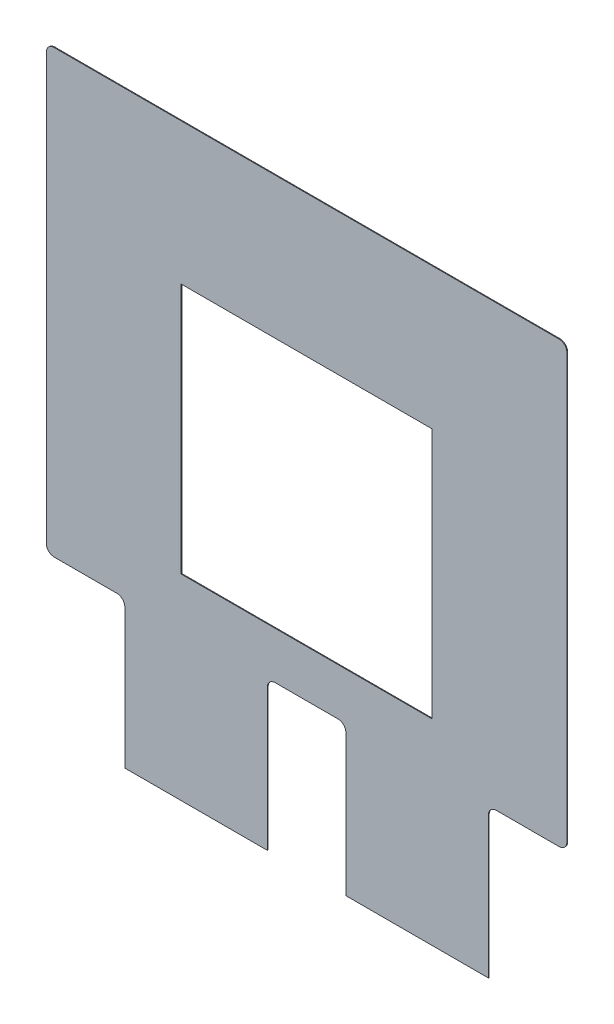
ISO-10303-21;
HEADER;
FILE_DESCRIPTION(('STEP AP214'),'2;1');
FILE_NAME('part.step','',(''),(''),'','','');
FILE_SCHEMA(('AUTOMOTIVE_DESIGN { 1 0 10303 214 1 1 1 1 }'));
ENDSEC;
DATA;
#1=APPLICATION_CONTEXT('core data for automotive mechanical design processes');
#2=APPLICATION_PROTOCOL_DEFINITION('international standard','automotive_design',2000,#1);
#3=PRODUCT_CONTEXT('',#1,'mechanical');
#4=PRODUCT('Part','Part','',(#3));
#5=PRODUCT_RELATED_PRODUCT_CATEGORY('part','',(#4));
#6=PRODUCT_DEFINITION_FORMATION('','',#4);
#7=PRODUCT_DEFINITION_CONTEXT('part definition',#1,'design');
#8=PRODUCT_DEFINITION('design','',#6,#7);
#9=PRODUCT_DEFINITION_SHAPE('','',#8);
#10=(LENGTH_UNIT() NAMED_UNIT(*) SI_UNIT(.MILLI.,.METRE.));
#11=(NAMED_UNIT(*) PLANE_ANGLE_UNIT() SI_UNIT($,.RADIAN.));
#12=(NAMED_UNIT(*) SI_UNIT($,.STERADIAN.) SOLID_ANGLE_UNIT());
#13=UNCERTAINTY_MEASURE_WITH_UNIT(LENGTH_MEASURE(1.E-05),#10,'distance_accuracy_value','');
#14=(GEOMETRIC_REPRESENTATION_CONTEXT(3) GLOBAL_UNCERTAINTY_ASSIGNED_CONTEXT((#13)) GLOBAL_UNIT_ASSIGNED_CONTEXT((#10,
#11,#12)) REPRESENTATION_CONTEXT('',''));
#15=CARTESIAN_POINT('',(0.,0.,0.));
#16=DIRECTION('',(0.,0.,1.));
#17=DIRECTION('',(1.,0.,0.));
#18=AXIS2_PLACEMENT_3D('',#15,#16,#17);
#19=CARTESIAN_POINT('',(47.7124343833155,28.0822771712,0.1));
#20=DIRECTION('',(0.,0.,1.));
#21=DIRECTION('',(1.,0.,0.));
#22=AXIS2_PLACEMENT_3D('',#19,#20,#21);
#23=PLANE('',#22);
#24=CARTESIAN_POINT('',(47.7124343833155,28.0822771712,0.1));
#25=DIRECTION('',(0.,0.,1.));
#26=DIRECTION('',(1.,0.,0.));
#27=AXIS2_PLACEMENT_3D('',#24,#25,#26);
#28=CIRCLE('',#27,1.);
#29=CARTESIAN_POINT('',(48.7124343833155,28.0822771712,0.1));
#30=VERTEX_POINT('',#29);
#31=CARTESIAN_POINT('',(47.7124343833155,29.0822771712,0.1));
#32=VERTEX_POINT('',#31);
#33=EDGE_CURVE('E230',#30,#32,#28,.T.);
#34=ORIENTED_EDGE('',*,*,#33,.T.);
#35=DIRECTION('',(-1.,0.,0.));
#36=VECTOR('',#35,1.);
#37=CARTESIAN_POINT('',(34.7124343833154,29.0822771712,0.1));
#38=LINE('',#37,#36);
#39=CARTESIAN_POINT('',(-16.614788352,29.0822771712,0.1));
#40=VERTEX_POINT('',#39);
#41=EDGE_CURVE('E233',#32,#40,#38,.T.);
#42=ORIENTED_EDGE('',*,*,#41,.T.);
#43=CARTESIAN_POINT('',(-16.614788352,28.0822771712,0.1));
#44=DIRECTION('',(0.,0.,1.));
#45=DIRECTION('',(1.,0.,0.));
#46=AXIS2_PLACEMENT_3D('',#43,#44,#45);
#47=CIRCLE('',#46,1.);
#48=CARTESIAN_POINT('',(-17.614788352,28.0822771712,0.1));
#49=VERTEX_POINT('',#48);
#50=EDGE_CURVE('E236',#40,#49,#47,.T.);
#51=ORIENTED_EDGE('',*,*,#50,.T.);
#52=DIRECTION('',(0.,-1.,0.));
#53=VECTOR('',#52,1.);
#54=CARTESIAN_POINT('',(-17.614788352,28.0822771712,0.1));
#55=LINE('',#54,#53);
#56=CARTESIAN_POINT('',(-17.614788352,-26.1394487439421,0.1));
#57=VERTEX_POINT('',#56);
#58=EDGE_CURVE('E238',#49,#57,#55,.T.);
#59=ORIENTED_EDGE('',*,*,#58,.T.);
#60=CARTESIAN_POINT('',(-16.614788352,-26.1394487439421,0.1));
#61=DIRECTION('',(0.,0.,1.));
#62=DIRECTION('',(1.,0.,0.));
#63=AXIS2_PLACEMENT_3D('',#60,#61,#62);
#64=CIRCLE('',#63,1.);
#65=CARTESIAN_POINT('',(-16.614788352,-27.1394487439421,0.1));
#66=VERTEX_POINT('',#65);
#67=EDGE_CURVE('E240',#57,#66,#64,.T.);
#68=ORIENTED_EDGE('',*,*,#67,.T.);
#69=DIRECTION('',(1.,0.,0.));
#70=VECTOR('',#69,1.);
#71=CARTESIAN_POINT('',(-16.614788352,-27.1394487439421,0.1));
#72=LINE('',#71,#70);
#73=CARTESIAN_POINT('',(-8.61478835200001,-27.1394487439421,0.1));
#74=VERTEX_POINT('',#73);
#75=EDGE_CURVE('E242',#66,#74,#72,.T.);
#76=ORIENTED_EDGE('',*,*,#75,.T.);
#77=CARTESIAN_POINT('',(-8.61478835200001,-28.1394487439421,0.1));
#78=DIRECTION('',(0.,0.,-1.));
#79=DIRECTION('',(1.,0.,0.));
#80=AXIS2_PLACEMENT_3D('',#77,#78,#79);
#81=CIRCLE('',#80,0.999999999999999);
#82=CARTESIAN_POINT('',(-7.61478835200001,-28.1394487439421,0.1));
#83=VERTEX_POINT('',#82);
#84=EDGE_CURVE('E244',#74,#83,#81,.T.);
#85=ORIENTED_EDGE('',*,*,#84,.T.);
#86=DIRECTION('',(0.,-1.,0.));
#87=VECTOR('',#86,1.);
#88=CARTESIAN_POINT('',(-7.61478835200001,-28.1394487439421,0.1));
#89=LINE('',#88,#87);
#90=CARTESIAN_POINT('',(-7.61478835200001,-45.9177228288,0.1));
#91=VERTEX_POINT('',#90);
#92=EDGE_CURVE('E246',#83,#91,#89,.T.);
#93=ORIENTED_EDGE('',*,*,#92,.T.);
#94=DIRECTION('',(1.,0.,0.));
#95=VECTOR('',#94,1.);
#96=CARTESIAN_POINT('',(-7.61478835200001,-45.9177228288,0.1));
#97=LINE('',#96,#95);
#98=CARTESIAN_POINT('',(10.5488230156577,-45.9177228288,0.1));
#99=VERTEX_POINT('',#98);
#100=EDGE_CURVE('E248',#91,#99,#97,.T.);
#101=ORIENTED_EDGE('',*,*,#100,.T.);
#102=DIRECTION('',(0.,1.,0.));
#103=VECTOR('',#102,1.);
#104=CARTESIAN_POINT('',(10.5488230156577,-45.9177228288,0.1));
#105=LINE('',#104,#103);
#106=CARTESIAN_POINT('',(10.5488230156577,-27.9177228288,0.1));
#107=VERTEX_POINT('',#106);
#108=EDGE_CURVE('E250',#99,#107,#105,.T.);
#109=ORIENTED_EDGE('',*,*,#108,.T.);
#110=CARTESIAN_POINT('',(11.5488230156577,-27.9177228288,0.1));
#111=DIRECTION('',(0.,0.,-1.));
#112=DIRECTION('',(1.,0.,0.));
#113=AXIS2_PLACEMENT_3D('',#110,#111,#112);
#114=CIRCLE('',#113,0.999999999999994);
#115=CARTESIAN_POINT('',(11.5488230156577,-26.9177228288,0.1));
#116=VERTEX_POINT('',#115);
#117=EDGE_CURVE('E252',#107,#116,#114,.T.);
#118=ORIENTED_EDGE('',*,*,#117,.T.);
#119=DIRECTION('',(1.,0.,0.));
#120=VECTOR('',#119,1.);
#121=CARTESIAN_POINT('',(11.5488230156577,-26.9177228288,0.1));
#122=LINE('',#121,#120);
#123=CARTESIAN_POINT('',(19.5488230156577,-26.9177228288,0.1));
#124=VERTEX_POINT('',#123);
#125=EDGE_CURVE('E254',#116,#124,#122,.T.);
#126=ORIENTED_EDGE('',*,*,#125,.T.);
#127=CARTESIAN_POINT('',(19.5488230156577,-27.9177228288,0.1));
#128=DIRECTION('',(0.,0.,-1.));
#129=DIRECTION('',(1.,0.,0.));
#130=AXIS2_PLACEMENT_3D('',#127,#128,#129);
#131=CIRCLE('',#130,0.999999999999994);
#132=CARTESIAN_POINT('',(20.5488230156577,-27.9177228288,0.1));
#133=VERTEX_POINT('',#132);
#134=EDGE_CURVE('E256',#124,#133,#131,.T.);
#135=ORIENTED_EDGE('',*,*,#134,.T.);
#136=DIRECTION('',(0.,-1.,0.));
#137=VECTOR('',#136,1.);
#138=CARTESIAN_POINT('',(20.5488230156577,-27.9177228288,0.1));
#139=LINE('',#138,#137);
#140=CARTESIAN_POINT('',(20.5488230156577,-45.9177228288,0.1));
#141=VERTEX_POINT('',#140);
#142=EDGE_CURVE('E258',#133,#141,#139,.T.);
#143=ORIENTED_EDGE('',*,*,#142,.T.);
#144=DIRECTION('',(1.,0.,0.));
#145=VECTOR('',#144,1.);
#146=CARTESIAN_POINT('',(20.5488230156577,-45.9177228288,0.1));
#147=LINE('',#146,#145);
#148=CARTESIAN_POINT('',(38.7124343833155,-45.9177228288,0.1));
#149=VERTEX_POINT('',#148);
#150=EDGE_CURVE('E260',#141,#149,#147,.T.);
#151=ORIENTED_EDGE('',*,*,#150,.T.);
#152=DIRECTION('',(0.,1.,0.));
#153=VECTOR('',#152,1.);
#154=CARTESIAN_POINT('',(38.7124343833155,-45.9177228288,0.1));
#155=LINE('',#154,#153);
#156=CARTESIAN_POINT('',(38.7124343833155,-27.9177228288,0.1));
#157=VERTEX_POINT('',#156);
#158=EDGE_CURVE('E262',#149,#157,#155,.T.);
#159=ORIENTED_EDGE('',*,*,#158,.T.);
#160=CARTESIAN_POINT('',(39.7124343833154,-27.9177228288,0.1));
#161=DIRECTION('',(0.,0.,-1.));
#162=DIRECTION('',(1.,0.,0.));
#163=AXIS2_PLACEMENT_3D('',#160,#161,#162);
#164=CIRCLE('',#163,0.999999999999987);
#165=CARTESIAN_POINT('',(39.7124343833154,-26.9177228288,0.1));
#166=VERTEX_POINT('',#165);
#167=EDGE_CURVE('E264',#157,#166,#164,.T.);
#168=ORIENTED_EDGE('',*,*,#167,.T.);
#169=DIRECTION('',(1.,0.,0.));
#170=VECTOR('',#169,1.);
#171=CARTESIAN_POINT('',(39.7124343833154,-26.9177228288,0.1));
#172=LINE('',#171,#170);
#173=CARTESIAN_POINT('',(47.7124343833155,-26.9177228288,0.1));
#174=VERTEX_POINT('',#173);
#175=EDGE_CURVE('E266',#166,#174,#172,.T.);
#176=ORIENTED_EDGE('',*,*,#175,.T.);
#177=CARTESIAN_POINT('',(47.7124343833155,-25.9177228288,0.1));
#178=DIRECTION('',(0.,0.,1.));
#179=DIRECTION('',(1.,0.,0.));
#180=AXIS2_PLACEMENT_3D('',#177,#178,#179);
#181=CIRCLE('',#180,1.);
#182=CARTESIAN_POINT('',(48.7124343833155,-25.9177228288,0.1));
#183=VERTEX_POINT('',#182);
#184=EDGE_CURVE('E268',#174,#183,#181,.T.);
#185=ORIENTED_EDGE('',*,*,#184,.T.);
#186=DIRECTION('',(0.,1.,0.));
#187=VECTOR('',#186,1.);
#188=CARTESIAN_POINT('',(48.7124343833155,-25.9177228288,0.1));
#189=LINE('',#188,#187);
#190=EDGE_CURVE('E270',#183,#30,#189,.T.);
#191=ORIENTED_EDGE('',*,*,#190,.T.);
#192=EDGE_LOOP('',(#34,#42,#51,#59,#68,#76,#85,#93,#101,#109,#118,#126,#135,#143,#151,#159,#168,
#176,#185,#191));
#193=FACE_BOUND('',#192,.T.);
#194=DIRECTION('',(0.,-1.,0.));
#195=VECTOR('',#194,1.);
#196=CARTESIAN_POINT('',(-0.451176984342311,-20.9177228288,0.1));
#197=LINE('',#196,#195);
#198=CARTESIAN_POINT('',(-0.451176984342297,11.0822771712,0.1));
#199=VERTEX_POINT('',#198);
#200=CARTESIAN_POINT('',(-0.451176984342311,-20.9177228288,0.1));
#201=VERTEX_POINT('',#200);
#202=EDGE_CURVE('E200',#199,#201,#197,.T.);
#203=ORIENTED_EDGE('',*,*,#202,.F.);
#204=DIRECTION('',(-1.,0.,0.));
#205=VECTOR('',#204,1.);
#206=CARTESIAN_POINT('',(16.0488230156577,11.0822771712,0.1));
#207=LINE('',#206,#205);
#208=CARTESIAN_POINT('',(31.5488230156577,11.0822771712,0.1));
#209=VERTEX_POINT('',#208);
#210=EDGE_CURVE('E192',#209,#199,#207,.T.);
#211=ORIENTED_EDGE('',*,*,#210,.F.);
#212=DIRECTION('',(0.,1.,0.));
#213=VECTOR('',#212,1.);
#214=CARTESIAN_POINT('',(31.5488230156577,11.0822771712,0.1));
#215=LINE('',#214,#213);
#216=CARTESIAN_POINT('',(31.5488230156577,-20.9177228288,0.1));
#217=VERTEX_POINT('',#216);
#218=EDGE_CURVE('E215',#217,#209,#215,.T.);
#219=ORIENTED_EDGE('',*,*,#218,.F.);
#220=DIRECTION('',(1.,0.,0.));
#221=VECTOR('',#220,1.);
#222=CARTESIAN_POINT('',(31.5488230156577,-20.9177228288,0.1));
#223=LINE('',#222,#221);
#224=EDGE_CURVE('E213',#201,#217,#223,.T.);
#225=ORIENTED_EDGE('',*,*,#224,.F.);
#226=EDGE_LOOP('',(#203,#211,#219,#225));
#227=FACE_BOUND('',#226,.T.);
#228=ADVANCED_FACE('F33',(#193,#227),#23,.T.);
#229=CARTESIAN_POINT('',(47.7124343833155,28.0822771712,0.));
#230=DIRECTION('',(0.,0.,1.));
#231=DIRECTION('',(1.,0.,0.));
#232=AXIS2_PLACEMENT_3D('',#229,#230,#231);
#233=PLANE('',#232);
#234=CARTESIAN_POINT('',(47.7124343833155,28.0822771712,0.));
#235=DIRECTION('',(0.,0.,1.));
#236=DIRECTION('',(1.,0.,0.));
#237=AXIS2_PLACEMENT_3D('',#234,#235,#236);
#238=CIRCLE('',#237,1.);
#239=CARTESIAN_POINT('',(48.7124343833155,28.0822771712,0.));
#240=VERTEX_POINT('',#239);
#241=CARTESIAN_POINT('',(47.7124343833155,29.0822771712,0.));
#242=VERTEX_POINT('',#241);
#243=EDGE_CURVE('E209',#240,#242,#238,.T.);
#244=ORIENTED_EDGE('',*,*,#243,.F.);
#245=DIRECTION('',(0.,1.,0.));
#246=VECTOR('',#245,1.);
#247=CARTESIAN_POINT('',(48.7124343833155,-25.9177228288,0.));
#248=LINE('',#247,#246);
#249=CARTESIAN_POINT('',(48.7124343833155,-25.9177228288,0.));
#250=VERTEX_POINT('',#249);
#251=EDGE_CURVE('E234',#250,#240,#248,.T.);
#252=ORIENTED_EDGE('',*,*,#251,.F.);
#253=CARTESIAN_POINT('',(47.7124343833155,-25.9177228288,0.));
#254=DIRECTION('',(0.,0.,1.));
#255=DIRECTION('',(1.,0.,0.));
#256=AXIS2_PLACEMENT_3D('',#253,#254,#255);
#257=CIRCLE('',#256,1.);
#258=CARTESIAN_POINT('',(47.7124343833155,-26.9177228288,0.));
#259=VERTEX_POINT('',#258);
#260=EDGE_CURVE('E309',#259,#250,#257,.T.);
#261=ORIENTED_EDGE('',*,*,#260,.F.);
#262=DIRECTION('',(1.,0.,0.));
#263=VECTOR('',#262,1.);
#264=CARTESIAN_POINT('',(39.7124343833154,-26.9177228288,0.));
#265=LINE('',#264,#263);
#266=CARTESIAN_POINT('',(39.7124343833154,-26.9177228288,0.));
#267=VERTEX_POINT('',#266);
#268=EDGE_CURVE('E307',#267,#259,#265,.T.);
#269=ORIENTED_EDGE('',*,*,#268,.F.);
#270=CARTESIAN_POINT('',(39.7124343833154,-27.9177228288,0.));
#271=DIRECTION('',(0.,0.,-1.));
#272=DIRECTION('',(1.,0.,0.));
#273=AXIS2_PLACEMENT_3D('',#270,#271,#272);
#274=CIRCLE('',#273,0.999999999999987);
#275=CARTESIAN_POINT('',(38.7124343833155,-27.9177228288,0.));
#276=VERTEX_POINT('',#275);
#277=EDGE_CURVE('E305',#276,#267,#274,.T.);
#278=ORIENTED_EDGE('',*,*,#277,.F.);
#279=DIRECTION('',(0.,1.,0.));
#280=VECTOR('',#279,1.);
#281=CARTESIAN_POINT('',(38.7124343833155,-45.9177228288,0.));
#282=LINE('',#281,#280);
#283=CARTESIAN_POINT('',(38.7124343833155,-45.9177228288,0.));
#284=VERTEX_POINT('',#283);
#285=EDGE_CURVE('E303',#284,#276,#282,.T.);
#286=ORIENTED_EDGE('',*,*,#285,.F.);
#287=DIRECTION('',(1.,0.,0.));
#288=VECTOR('',#287,1.);
#289=CARTESIAN_POINT('',(20.5488230156577,-45.9177228288,0.));
#290=LINE('',#289,#288);
#291=CARTESIAN_POINT('',(20.5488230156577,-45.9177228288,0.));
#292=VERTEX_POINT('',#291);
#293=EDGE_CURVE('E301',#292,#284,#290,.T.);
#294=ORIENTED_EDGE('',*,*,#293,.F.);
#295=DIRECTION('',(0.,-1.,0.));
#296=VECTOR('',#295,1.);
#297=CARTESIAN_POINT('',(20.5488230156577,-27.9177228288,0.));
#298=LINE('',#297,#296);
#299=CARTESIAN_POINT('',(20.5488230156577,-27.9177228288,0.));
#300=VERTEX_POINT('',#299);
#301=EDGE_CURVE('E299',#300,#292,#298,.T.);
#302=ORIENTED_EDGE('',*,*,#301,.F.);
#303=CARTESIAN_POINT('',(19.5488230156577,-27.9177228288,0.));
#304=DIRECTION('',(0.,0.,-1.));
#305=DIRECTION('',(1.,0.,0.));
#306=AXIS2_PLACEMENT_3D('',#303,#304,#305);
#307=CIRCLE('',#306,0.999999999999994);
#308=CARTESIAN_POINT('',(19.5488230156577,-26.9177228288,0.));
#309=VERTEX_POINT('',#308);
#310=EDGE_CURVE('E297',#309,#300,#307,.T.);
#311=ORIENTED_EDGE('',*,*,#310,.F.);
#312=DIRECTION('',(1.,0.,0.));
#313=VECTOR('',#312,1.);
#314=CARTESIAN_POINT('',(11.5488230156577,-26.9177228288,0.));
#315=LINE('',#314,#313);
#316=CARTESIAN_POINT('',(11.5488230156577,-26.9177228288,0.));
#317=VERTEX_POINT('',#316);
#318=EDGE_CURVE('E295',#317,#309,#315,.T.);
#319=ORIENTED_EDGE('',*,*,#318,.F.);
#320=CARTESIAN_POINT('',(11.5488230156577,-27.9177228288,0.));
#321=DIRECTION('',(0.,0.,-1.));
#322=DIRECTION('',(1.,0.,0.));
#323=AXIS2_PLACEMENT_3D('',#320,#321,#322);
#324=CIRCLE('',#323,0.999999999999994);
#325=CARTESIAN_POINT('',(10.5488230156577,-27.9177228288,0.));
#326=VERTEX_POINT('',#325);
#327=EDGE_CURVE('E293',#326,#317,#324,.T.);
#328=ORIENTED_EDGE('',*,*,#327,.F.);
#329=DIRECTION('',(0.,1.,0.));
#330=VECTOR('',#329,1.);
#331=CARTESIAN_POINT('',(10.5488230156577,-45.9177228288,0.));
#332=LINE('',#331,#330);
#333=CARTESIAN_POINT('',(10.5488230156577,-45.9177228288,0.));
#334=VERTEX_POINT('',#333);
#335=EDGE_CURVE('E291',#334,#326,#332,.T.);
#336=ORIENTED_EDGE('',*,*,#335,.F.);
#337=DIRECTION('',(1.,0.,0.));
#338=VECTOR('',#337,1.);
#339=CARTESIAN_POINT('',(-7.61478835200001,-45.9177228288,0.));
#340=LINE('',#339,#338);
#341=CARTESIAN_POINT('',(-7.61478835200001,-45.9177228288,0.));
#342=VERTEX_POINT('',#341);
#343=EDGE_CURVE('E289',#342,#334,#340,.T.);
#344=ORIENTED_EDGE('',*,*,#343,.F.);
#345=DIRECTION('',(0.,-1.,0.));
#346=VECTOR('',#345,1.);
#347=CARTESIAN_POINT('',(-7.61478835200001,-28.1394487439421,0.));
#348=LINE('',#347,#346);
#349=CARTESIAN_POINT('',(-7.61478835200001,-28.1394487439421,0.));
#350=VERTEX_POINT('',#349);
#351=EDGE_CURVE('E287',#350,#342,#348,.T.);
#352=ORIENTED_EDGE('',*,*,#351,.F.);
#353=CARTESIAN_POINT('',(-8.61478835200001,-28.1394487439421,0.));
#354=DIRECTION('',(0.,0.,-1.));
#355=DIRECTION('',(1.,0.,0.));
#356=AXIS2_PLACEMENT_3D('',#353,#354,#355);
#357=CIRCLE('',#356,0.999999999999999);
#358=CARTESIAN_POINT('',(-8.61478835200001,-27.1394487439421,0.));
#359=VERTEX_POINT('',#358);
#360=EDGE_CURVE('E285',#359,#350,#357,.T.);
#361=ORIENTED_EDGE('',*,*,#360,.F.);
#362=DIRECTION('',(1.,0.,0.));
#363=VECTOR('',#362,1.);
#364=CARTESIAN_POINT('',(-16.614788352,-27.1394487439421,0.));
#365=LINE('',#364,#363);
#366=CARTESIAN_POINT('',(-16.614788352,-27.1394487439421,0.));
#367=VERTEX_POINT('',#366);
#368=EDGE_CURVE('E283',#367,#359,#365,.T.);
#369=ORIENTED_EDGE('',*,*,#368,.F.);
#370=CARTESIAN_POINT('',(-16.614788352,-26.1394487439421,0.));
#371=DIRECTION('',(0.,0.,1.));
#372=DIRECTION('',(1.,0.,0.));
#373=AXIS2_PLACEMENT_3D('',#370,#371,#372);
#374=CIRCLE('',#373,1.);
#375=CARTESIAN_POINT('',(-17.614788352,-26.1394487439421,0.));
#376=VERTEX_POINT('',#375);
#377=EDGE_CURVE('E281',#376,#367,#374,.T.);
#378=ORIENTED_EDGE('',*,*,#377,.F.);
#379=DIRECTION('',(0.,-1.,0.));
#380=VECTOR('',#379,1.);
#381=CARTESIAN_POINT('',(-17.614788352,28.0822771712,0.));
#382=LINE('',#381,#380);
#383=CARTESIAN_POINT('',(-17.614788352,28.0822771712,0.));
#384=VERTEX_POINT('',#383);
#385=EDGE_CURVE('E279',#384,#376,#382,.T.);
#386=ORIENTED_EDGE('',*,*,#385,.F.);
#387=CARTESIAN_POINT('',(-16.614788352,28.0822771712,0.));
#388=DIRECTION('',(0.,0.,1.));
#389=DIRECTION('',(1.,0.,0.));
#390=AXIS2_PLACEMENT_3D('',#387,#388,#389);
#391=CIRCLE('',#390,1.);
#392=CARTESIAN_POINT('',(-16.614788352,29.0822771712,0.));
#393=VERTEX_POINT('',#392);
#394=EDGE_CURVE('E277',#393,#384,#391,.T.);
#395=ORIENTED_EDGE('',*,*,#394,.F.);
#396=DIRECTION('',(-1.,0.,0.));
#397=VECTOR('',#396,1.);
#398=CARTESIAN_POINT('',(-3.61478835200001,29.0822771712,0.));
#399=LINE('',#398,#397);
#400=EDGE_CURVE('E275',#242,#393,#399,.T.);
#401=ORIENTED_EDGE('',*,*,#400,.F.);
#402=EDGE_LOOP('',(#244,#252,#261,#269,#278,#286,#294,#302,#311,#319,#328,#336,#344,#352,#361,
#369,#378,#386,#395,#401));
#403=FACE_BOUND('',#402,.T.);
#404=DIRECTION('',(-1.,0.,0.));
#405=VECTOR('',#404,1.);
#406=CARTESIAN_POINT('',(-0.451176984342297,11.0822771712,0.));
#407=LINE('',#406,#405);
#408=CARTESIAN_POINT('',(31.5488230156577,11.0822771712,0.));
#409=VERTEX_POINT('',#408);
#410=CARTESIAN_POINT('',(-0.451176984342297,11.0822771712,0.));
#411=VERTEX_POINT('',#410);
#412=EDGE_CURVE('E219',#409,#411,#407,.T.);
#413=ORIENTED_EDGE('',*,*,#412,.T.);
#414=DIRECTION('',(0.,-1.,0.));
#415=VECTOR('',#414,1.);
#416=CARTESIAN_POINT('',(-0.451176984342311,-20.9177228288,0.));
#417=LINE('',#416,#415);
#418=CARTESIAN_POINT('',(-0.451176984342311,-20.9177228288,0.));
#419=VERTEX_POINT('',#418);
#420=EDGE_CURVE('E207',#411,#419,#417,.T.);
#421=ORIENTED_EDGE('',*,*,#420,.T.);
#422=DIRECTION('',(1.,0.,0.));
#423=VECTOR('',#422,1.);
#424=CARTESIAN_POINT('',(31.5488230156577,-20.9177228288,0.));
#425=LINE('',#424,#423);
#426=CARTESIAN_POINT('',(31.5488230156577,-20.9177228288,0.));
#427=VERTEX_POINT('',#426);
#428=EDGE_CURVE('E222',#419,#427,#425,.T.);
#429=ORIENTED_EDGE('',*,*,#428,.T.);
#430=DIRECTION('',(0.,1.,0.));
#431=VECTOR('',#430,1.);
#432=CARTESIAN_POINT('',(31.5488230156577,11.0822771712,0.));
#433=LINE('',#432,#431);
#434=EDGE_CURVE('E201',#427,#409,#433,.T.);
#435=ORIENTED_EDGE('',*,*,#434,.T.);
#436=EDGE_LOOP('',(#413,#421,#429,#435));
#437=FACE_BOUND('',#436,.T.);
#438=ADVANCED_FACE('F375',(#403,#437),#233,.F.);
#439=CARTESIAN_POINT('',(47.7124343833155,28.0822771712,0.1));
#440=DIRECTION('',(0.,0.,-1.));
#441=DIRECTION('',(-1.,0.,0.));
#442=AXIS2_PLACEMENT_3D('',#439,#440,#441);
#443=CYLINDRICAL_SURFACE('',#442,1.);
#444=ORIENTED_EDGE('',*,*,#243,.T.);
#445=DIRECTION('',(0.,0.,-1.));
#446=VECTOR('',#445,1.);
#447=CARTESIAN_POINT('',(47.7124343833155,29.0822771712,0.1));
#448=LINE('',#447,#446);
#449=EDGE_CURVE('E11',#32,#242,#448,.T.);
#450=ORIENTED_EDGE('',*,*,#449,.F.);
#451=ORIENTED_EDGE('',*,*,#33,.F.);
#452=DIRECTION('',(0.,0.,-1.));
#453=VECTOR('',#452,1.);
#454=CARTESIAN_POINT('',(48.7124343833155,28.0822771712,0.1));
#455=LINE('',#454,#453);
#456=EDGE_CURVE('E272',#30,#240,#455,.T.);
#457=ORIENTED_EDGE('',*,*,#456,.T.);
#458=EDGE_LOOP('',(#444,#450,#451,#457));
#459=FACE_BOUND('',#458,.T.);
#460=ADVANCED_FACE('F35',(#459),#443,.T.);
#461=CARTESIAN_POINT('',(-3.61478835200001,29.0822771712,0.1));
#462=DIRECTION('',(0.,-1.,0.));
#463=DIRECTION('',(1.,0.,0.));
#464=AXIS2_PLACEMENT_3D('',#461,#462,#463);
#465=PLANE('',#464);
#466=ORIENTED_EDGE('',*,*,#400,.T.);
#467=DIRECTION('',(0.,0.,-1.));
#468=VECTOR('',#467,1.);
#469=CARTESIAN_POINT('',(-16.614788352,29.0822771712,0.1));
#470=LINE('',#469,#468);
#471=EDGE_CURVE('E41',#40,#393,#470,.T.);
#472=ORIENTED_EDGE('',*,*,#471,.F.);
#473=ORIENTED_EDGE('',*,*,#41,.F.);
#474=ORIENTED_EDGE('',*,*,#449,.T.);
#475=EDGE_LOOP('',(#466,#472,#473,#474));
#476=FACE_BOUND('',#475,.T.);
#477=ADVANCED_FACE('F392',(#476),#465,.F.);
#478=CARTESIAN_POINT('',(-16.614788352,28.0822771712,0.1));
#479=DIRECTION('',(0.,0.,-1.));
#480=DIRECTION('',(-1.,0.,0.));
#481=AXIS2_PLACEMENT_3D('',#478,#479,#480);
#482=CYLINDRICAL_SURFACE('',#481,1.);
#483=ORIENTED_EDGE('',*,*,#394,.T.);
#484=DIRECTION('',(0.,0.,-1.));
#485=VECTOR('',#484,1.);
#486=CARTESIAN_POINT('',(-17.614788352,28.0822771712,0.1));
#487=LINE('',#486,#485);
#488=EDGE_CURVE('E362',#49,#384,#487,.T.);
#489=ORIENTED_EDGE('',*,*,#488,.F.);
#490=ORIENTED_EDGE('',*,*,#50,.F.);
#491=ORIENTED_EDGE('',*,*,#471,.T.);
#492=EDGE_LOOP('',(#483,#489,#490,#491));
#493=FACE_BOUND('',#492,.T.);
#494=ADVANCED_FACE('F369',(#493),#482,.T.);
#495=CARTESIAN_POINT('',(-17.614788352,28.0822771712,0.1));
#496=DIRECTION('',(1.,0.,0.));
#497=DIRECTION('',(0.,0.,-1.));
#498=AXIS2_PLACEMENT_3D('',#495,#496,#497);
#499=PLANE('',#498);
#500=ORIENTED_EDGE('',*,*,#385,.T.);
#501=DIRECTION('',(0.,0.,-1.));
#502=VECTOR('',#501,1.);
#503=CARTESIAN_POINT('',(-17.614788352,-26.1394487439421,0.1));
#504=LINE('',#503,#502);
#505=EDGE_CURVE('E359',#57,#376,#504,.T.);
#506=ORIENTED_EDGE('',*,*,#505,.F.);
#507=ORIENTED_EDGE('',*,*,#58,.F.);
#508=ORIENTED_EDGE('',*,*,#488,.T.);
#509=EDGE_LOOP('',(#500,#506,#507,#508));
#510=FACE_BOUND('',#509,.T.);
#511=ADVANCED_FACE('F381',(#510),#499,.F.);
#512=CARTESIAN_POINT('',(-16.614788352,-26.1394487439421,0.1));
#513=DIRECTION('',(0.,0.,-1.));
#514=DIRECTION('',(-1.,0.,0.));
#515=AXIS2_PLACEMENT_3D('',#512,#513,#514);
#516=CYLINDRICAL_SURFACE('',#515,1.);
#517=ORIENTED_EDGE('',*,*,#377,.T.);
#518=DIRECTION('',(0.,0.,-1.));
#519=VECTOR('',#518,1.);
#520=CARTESIAN_POINT('',(-16.614788352,-27.1394487439421,0.1));
#521=LINE('',#520,#519);
#522=EDGE_CURVE('E356',#66,#367,#521,.T.);
#523=ORIENTED_EDGE('',*,*,#522,.F.);
#524=ORIENTED_EDGE('',*,*,#67,.F.);
#525=ORIENTED_EDGE('',*,*,#505,.T.);
#526=EDGE_LOOP('',(#517,#523,#524,#525));
#527=FACE_BOUND('',#526,.T.);
#528=ADVANCED_FACE('F385',(#527),#516,.T.);
#529=CARTESIAN_POINT('',(-16.614788352,-27.1394487439421,0.1));
#530=DIRECTION('',(0.,1.,0.));
#531=DIRECTION('',(0.,0.,1.));
#532=AXIS2_PLACEMENT_3D('',#529,#530,#531);
#533=PLANE('',#532);
#534=ORIENTED_EDGE('',*,*,#368,.T.);
#535=DIRECTION('',(0.,0.,-1.));
#536=VECTOR('',#535,1.);
#537=CARTESIAN_POINT('',(-8.61478835200001,-27.1394487439421,0.1));
#538=LINE('',#537,#536);
#539=EDGE_CURVE('E353',#74,#359,#538,.T.);
#540=ORIENTED_EDGE('',*,*,#539,.F.);
#541=ORIENTED_EDGE('',*,*,#75,.F.);
#542=ORIENTED_EDGE('',*,*,#522,.T.);
#543=EDGE_LOOP('',(#534,#540,#541,#542));
#544=FACE_BOUND('',#543,.T.);
#545=ADVANCED_FACE('F465',(#544),#533,.F.);
#546=CARTESIAN_POINT('',(-8.61478835200001,-28.1394487439421,0.1));
#547=DIRECTION('',(0.,0.,-1.));
#548=DIRECTION('',(-1.,0.,0.));
#549=AXIS2_PLACEMENT_3D('',#546,#547,#548);
#550=CYLINDRICAL_SURFACE('',#549,0.999999999999999);
#551=ORIENTED_EDGE('',*,*,#360,.T.);
#552=DIRECTION('',(0.,0.,-1.));
#553=VECTOR('',#552,1.);
#554=CARTESIAN_POINT('',(-7.61478835200001,-28.1394487439421,0.1));
#555=LINE('',#554,#553);
#556=EDGE_CURVE('E350',#83,#350,#555,.T.);
#557=ORIENTED_EDGE('',*,*,#556,.F.);
#558=ORIENTED_EDGE('',*,*,#84,.F.);
#559=ORIENTED_EDGE('',*,*,#539,.T.);
#560=EDGE_LOOP('',(#551,#557,#558,#559));
#561=FACE_BOUND('',#560,.T.);
#562=ADVANCED_FACE('F463',(#561),#550,.F.);
#563=CARTESIAN_POINT('',(-7.61478835200001,-28.1394487439421,0.1));
#564=DIRECTION('',(1.,0.,0.));
#565=DIRECTION('',(0.,0.,-1.));
#566=AXIS2_PLACEMENT_3D('',#563,#564,#565);
#567=PLANE('',#566);
#568=ORIENTED_EDGE('',*,*,#351,.T.);
#569=DIRECTION('',(0.,0.,-1.));
#570=VECTOR('',#569,1.);
#571=CARTESIAN_POINT('',(-7.61478835200001,-45.9177228288,0.1));
#572=LINE('',#571,#570);
#573=EDGE_CURVE('E347',#91,#342,#572,.T.);
#574=ORIENTED_EDGE('',*,*,#573,.F.);
#575=ORIENTED_EDGE('',*,*,#92,.F.);
#576=ORIENTED_EDGE('',*,*,#556,.T.);
#577=EDGE_LOOP('',(#568,#574,#575,#576));
#578=FACE_BOUND('',#577,.T.);
#579=ADVANCED_FACE('F458',(#578),#567,.F.);
#580=CARTESIAN_POINT('',(-7.61478835200001,-45.9177228288,0.1));
#581=DIRECTION('',(0.,1.,0.));
#582=DIRECTION('',(0.,0.,1.));
#583=AXIS2_PLACEMENT_3D('',#580,#581,#582);
#584=PLANE('',#583);
#585=ORIENTED_EDGE('',*,*,#343,.T.);
#586=DIRECTION('',(0.,0.,-1.));
#587=VECTOR('',#586,1.);
#588=CARTESIAN_POINT('',(10.5488230156577,-45.9177228288,0.1));
#589=LINE('',#588,#587);
#590=EDGE_CURVE('E344',#99,#334,#589,.T.);
#591=ORIENTED_EDGE('',*,*,#590,.F.);
#592=ORIENTED_EDGE('',*,*,#100,.F.);
#593=ORIENTED_EDGE('',*,*,#573,.T.);
#594=EDGE_LOOP('',(#585,#591,#592,#593));
#595=FACE_BOUND('',#594,.T.);
#596=ADVANCED_FACE('F453',(#595),#584,.F.);
#597=CARTESIAN_POINT('',(10.5488230156577,-45.9177228288,0.1));
#598=DIRECTION('',(-1.,0.,0.));
#599=DIRECTION('',(0.,0.,1.));
#600=AXIS2_PLACEMENT_3D('',#597,#598,#599);
#601=PLANE('',#600);
#602=ORIENTED_EDGE('',*,*,#335,.T.);
#603=DIRECTION('',(0.,0.,-1.));
#604=VECTOR('',#603,1.);
#605=CARTESIAN_POINT('',(10.5488230156577,-27.9177228288,0.1));
#606=LINE('',#605,#604);
#607=EDGE_CURVE('E341',#107,#326,#606,.T.);
#608=ORIENTED_EDGE('',*,*,#607,.F.);
#609=ORIENTED_EDGE('',*,*,#108,.F.);
#610=ORIENTED_EDGE('',*,*,#590,.T.);
#611=EDGE_LOOP('',(#602,#608,#609,#610));
#612=FACE_BOUND('',#611,.T.);
#613=ADVANCED_FACE('F449',(#612),#601,.F.);
#614=CARTESIAN_POINT('',(11.5488230156577,-27.9177228288,0.1));
#615=DIRECTION('',(0.,0.,-1.));
#616=DIRECTION('',(-1.,0.,0.));
#617=AXIS2_PLACEMENT_3D('',#614,#615,#616);
#618=CYLINDRICAL_SURFACE('',#617,0.999999999999994);
#619=ORIENTED_EDGE('',*,*,#327,.T.);
#620=DIRECTION('',(0.,0.,-1.));
#621=VECTOR('',#620,1.);
#622=CARTESIAN_POINT('',(11.5488230156577,-26.9177228288,0.1));
#623=LINE('',#622,#621);
#624=EDGE_CURVE('E338',#116,#317,#623,.T.);
#625=ORIENTED_EDGE('',*,*,#624,.F.);
#626=ORIENTED_EDGE('',*,*,#117,.F.);
#627=ORIENTED_EDGE('',*,*,#607,.T.);
#628=EDGE_LOOP('',(#619,#625,#626,#627));
#629=FACE_BOUND('',#628,.T.);
#630=ADVANCED_FACE('F444',(#629),#618,.F.);
#631=CARTESIAN_POINT('',(11.5488230156577,-26.9177228288,0.1));
#632=DIRECTION('',(0.,1.,0.));
#633=DIRECTION('',(0.,0.,1.));
#634=AXIS2_PLACEMENT_3D('',#631,#632,#633);
#635=PLANE('',#634);
#636=ORIENTED_EDGE('',*,*,#318,.T.);
#637=DIRECTION('',(0.,0.,-1.));
#638=VECTOR('',#637,1.);
#639=CARTESIAN_POINT('',(19.5488230156577,-26.9177228288,0.1));
#640=LINE('',#639,#638);
#641=EDGE_CURVE('E335',#124,#309,#640,.T.);
#642=ORIENTED_EDGE('',*,*,#641,.F.);
#643=ORIENTED_EDGE('',*,*,#125,.F.);
#644=ORIENTED_EDGE('',*,*,#624,.T.);
#645=EDGE_LOOP('',(#636,#642,#643,#644));
#646=FACE_BOUND('',#645,.T.);
#647=ADVANCED_FACE('F438',(#646),#635,.F.);
#648=CARTESIAN_POINT('',(19.5488230156577,-27.9177228288,0.1));
#649=DIRECTION('',(0.,0.,-1.));
#650=DIRECTION('',(-1.,0.,0.));
#651=AXIS2_PLACEMENT_3D('',#648,#649,#650);
#652=CYLINDRICAL_SURFACE('',#651,0.999999999999994);
#653=ORIENTED_EDGE('',*,*,#310,.T.);
#654=DIRECTION('',(0.,0.,-1.));
#655=VECTOR('',#654,1.);
#656=CARTESIAN_POINT('',(20.5488230156577,-27.9177228288,0.1));
#657=LINE('',#656,#655);
#658=EDGE_CURVE('E332',#133,#300,#657,.T.);
#659=ORIENTED_EDGE('',*,*,#658,.F.);
#660=ORIENTED_EDGE('',*,*,#134,.F.);
#661=ORIENTED_EDGE('',*,*,#641,.T.);
#662=EDGE_LOOP('',(#653,#659,#660,#661));
#663=FACE_BOUND('',#662,.T.);
#664=ADVANCED_FACE('F434',(#663),#652,.F.);
#665=CARTESIAN_POINT('',(20.5488230156577,-27.9177228288,0.1));
#666=DIRECTION('',(1.,0.,0.));
#667=DIRECTION('',(0.,0.,-1.));
#668=AXIS2_PLACEMENT_3D('',#665,#666,#667);
#669=PLANE('',#668);
#670=ORIENTED_EDGE('',*,*,#301,.T.);
#671=DIRECTION('',(0.,0.,-1.));
#672=VECTOR('',#671,1.);
#673=CARTESIAN_POINT('',(20.5488230156577,-45.9177228288,0.1));
#674=LINE('',#673,#672);
#675=EDGE_CURVE('E329',#141,#292,#674,.T.);
#676=ORIENTED_EDGE('',*,*,#675,.F.);
#677=ORIENTED_EDGE('',*,*,#142,.F.);
#678=ORIENTED_EDGE('',*,*,#658,.T.);
#679=EDGE_LOOP('',(#670,#676,#677,#678));
#680=FACE_BOUND('',#679,.T.);
#681=ADVANCED_FACE('F429',(#680),#669,.F.);
#682=CARTESIAN_POINT('',(20.5488230156577,-45.9177228288,0.1));
#683=DIRECTION('',(0.,1.,0.));
#684=DIRECTION('',(0.,0.,1.));
#685=AXIS2_PLACEMENT_3D('',#682,#683,#684);
#686=PLANE('',#685);
#687=ORIENTED_EDGE('',*,*,#293,.T.);
#688=DIRECTION('',(0.,0.,-1.));
#689=VECTOR('',#688,1.);
#690=CARTESIAN_POINT('',(38.7124343833155,-45.9177228288,0.1));
#691=LINE('',#690,#689);
#692=EDGE_CURVE('E326',#149,#284,#691,.T.);
#693=ORIENTED_EDGE('',*,*,#692,.F.);
#694=ORIENTED_EDGE('',*,*,#150,.F.);
#695=ORIENTED_EDGE('',*,*,#675,.T.);
#696=EDGE_LOOP('',(#687,#693,#694,#695));
#697=FACE_BOUND('',#696,.T.);
#698=ADVANCED_FACE('F423',(#697),#686,.F.);
#699=CARTESIAN_POINT('',(38.7124343833155,-45.9177228288,0.1));
#700=DIRECTION('',(-1.,0.,0.));
#701=DIRECTION('',(0.,0.,1.));
#702=AXIS2_PLACEMENT_3D('',#699,#700,#701);
#703=PLANE('',#702);
#704=ORIENTED_EDGE('',*,*,#285,.T.);
#705=DIRECTION('',(0.,0.,-1.));
#706=VECTOR('',#705,1.);
#707=CARTESIAN_POINT('',(38.7124343833155,-27.9177228288,0.1));
#708=LINE('',#707,#706);
#709=EDGE_CURVE('E323',#157,#276,#708,.T.);
#710=ORIENTED_EDGE('',*,*,#709,.F.);
#711=ORIENTED_EDGE('',*,*,#158,.F.);
#712=ORIENTED_EDGE('',*,*,#692,.T.);
#713=EDGE_LOOP('',(#704,#710,#711,#712));
#714=FACE_BOUND('',#713,.T.);
#715=ADVANCED_FACE('F419',(#714),#703,.F.);
#716=CARTESIAN_POINT('',(39.7124343833154,-27.9177228288,0.1));
#717=DIRECTION('',(0.,0.,-1.));
#718=DIRECTION('',(-1.,0.,0.));
#719=AXIS2_PLACEMENT_3D('',#716,#717,#718);
#720=CYLINDRICAL_SURFACE('',#719,0.999999999999987);
#721=ORIENTED_EDGE('',*,*,#277,.T.);
#722=DIRECTION('',(0.,0.,-1.));
#723=VECTOR('',#722,1.);
#724=CARTESIAN_POINT('',(39.7124343833154,-26.9177228288,0.1));
#725=LINE('',#724,#723);
#726=EDGE_CURVE('E320',#166,#267,#725,.T.);
#727=ORIENTED_EDGE('',*,*,#726,.F.);
#728=ORIENTED_EDGE('',*,*,#167,.F.);
#729=ORIENTED_EDGE('',*,*,#709,.T.);
#730=EDGE_LOOP('',(#721,#727,#728,#729));
#731=FACE_BOUND('',#730,.T.);
#732=ADVANCED_FACE('F414',(#731),#720,.F.);
#733=CARTESIAN_POINT('',(39.7124343833154,-26.9177228288,0.1));
#734=DIRECTION('',(0.,1.,0.));
#735=DIRECTION('',(0.,0.,1.));
#736=AXIS2_PLACEMENT_3D('',#733,#734,#735);
#737=PLANE('',#736);
#738=ORIENTED_EDGE('',*,*,#268,.T.);
#739=DIRECTION('',(0.,0.,-1.));
#740=VECTOR('',#739,1.);
#741=CARTESIAN_POINT('',(47.7124343833155,-26.9177228288,0.1));
#742=LINE('',#741,#740);
#743=EDGE_CURVE('E317',#174,#259,#742,.T.);
#744=ORIENTED_EDGE('',*,*,#743,.F.);
#745=ORIENTED_EDGE('',*,*,#175,.F.);
#746=ORIENTED_EDGE('',*,*,#726,.T.);
#747=EDGE_LOOP('',(#738,#744,#745,#746));
#748=FACE_BOUND('',#747,.T.);
#749=ADVANCED_FACE('F408',(#748),#737,.F.);
#750=CARTESIAN_POINT('',(47.7124343833155,-25.9177228288,0.1));
#751=DIRECTION('',(0.,0.,-1.));
#752=DIRECTION('',(-1.,0.,0.));
#753=AXIS2_PLACEMENT_3D('',#750,#751,#752);
#754=CYLINDRICAL_SURFACE('',#753,1.);
#755=ORIENTED_EDGE('',*,*,#260,.T.);
#756=DIRECTION('',(0.,0.,-1.));
#757=VECTOR('',#756,1.);
#758=CARTESIAN_POINT('',(48.7124343833155,-25.9177228288,0.1));
#759=LINE('',#758,#757);
#760=EDGE_CURVE('E314',#183,#250,#759,.T.);
#761=ORIENTED_EDGE('',*,*,#760,.F.);
#762=ORIENTED_EDGE('',*,*,#184,.F.);
#763=ORIENTED_EDGE('',*,*,#743,.T.);
#764=EDGE_LOOP('',(#755,#761,#762,#763));
#765=FACE_BOUND('',#764,.T.);
#766=ADVANCED_FACE('F404',(#765),#754,.T.);
#767=CARTESIAN_POINT('',(48.7124343833155,-25.9177228288,0.1));
#768=DIRECTION('',(-1.,0.,0.));
#769=DIRECTION('',(0.,0.,1.));
#770=AXIS2_PLACEMENT_3D('',#767,#768,#769);
#771=PLANE('',#770);
#772=ORIENTED_EDGE('',*,*,#251,.T.);
#773=ORIENTED_EDGE('',*,*,#456,.F.);
#774=ORIENTED_EDGE('',*,*,#190,.F.);
#775=ORIENTED_EDGE('',*,*,#760,.T.);
#776=EDGE_LOOP('',(#772,#773,#774,#775));
#777=FACE_BOUND('',#776,.T.);
#778=ADVANCED_FACE('F399',(#777),#771,.F.);
#779=CARTESIAN_POINT('',(-0.451176984342297,11.0822771712,0.1));
#780=DIRECTION('',(0.,-1.,0.));
#781=DIRECTION('',(0.,0.,-1.));
#782=AXIS2_PLACEMENT_3D('',#779,#780,#781);
#783=PLANE('',#782);
#784=ORIENTED_EDGE('',*,*,#412,.F.);
#785=DIRECTION('',(0.,0.,-1.));
#786=VECTOR('',#785,1.);
#787=CARTESIAN_POINT('',(31.5488230156577,11.0822771712,0.1));
#788=LINE('',#787,#786);
#789=EDGE_CURVE('E53',#209,#409,#788,.T.);
#790=ORIENTED_EDGE('',*,*,#789,.F.);
#791=ORIENTED_EDGE('',*,*,#210,.T.);
#792=DIRECTION('',(0.,0.,-1.));
#793=VECTOR('',#792,1.);
#794=CARTESIAN_POINT('',(-0.451176984342297,11.0822771712,0.1));
#795=LINE('',#794,#793);
#796=EDGE_CURVE('E195',#199,#411,#795,.T.);
#797=ORIENTED_EDGE('',*,*,#796,.T.);
#798=EDGE_LOOP('',(#784,#790,#791,#797));
#799=FACE_BOUND('',#798,.T.);
#800=ADVANCED_FACE('F194',(#799),#783,.T.);
#801=CARTESIAN_POINT('',(-0.451176984342311,-20.9177228288,0.1));
#802=DIRECTION('',(1.,0.,0.));
#803=DIRECTION('',(0.,1.,0.));
#804=AXIS2_PLACEMENT_3D('',#801,#802,#803);
#805=PLANE('',#804);
#806=ORIENTED_EDGE('',*,*,#420,.F.);
#807=ORIENTED_EDGE('',*,*,#796,.F.);
#808=ORIENTED_EDGE('',*,*,#202,.T.);
#809=DIRECTION('',(0.,0.,-1.));
#810=VECTOR('',#809,1.);
#811=CARTESIAN_POINT('',(-0.451176984342311,-20.9177228288,0.1));
#812=LINE('',#811,#810);
#813=EDGE_CURVE('E210',#201,#419,#812,.T.);
#814=ORIENTED_EDGE('',*,*,#813,.T.);
#815=EDGE_LOOP('',(#806,#807,#808,#814));
#816=FACE_BOUND('',#815,.T.);
#817=ADVANCED_FACE('F204',(#816),#805,.T.);
#818=CARTESIAN_POINT('',(31.5488230156577,-20.9177228288,0.1));
#819=DIRECTION('',(0.,1.,0.));
#820=DIRECTION('',(0.,0.,1.));
#821=AXIS2_PLACEMENT_3D('',#818,#819,#820);
#822=PLANE('',#821);
#823=ORIENTED_EDGE('',*,*,#428,.F.);
#824=ORIENTED_EDGE('',*,*,#813,.F.);
#825=ORIENTED_EDGE('',*,*,#224,.T.);
#826=DIRECTION('',(0.,0.,-1.));
#827=VECTOR('',#826,1.);
#828=CARTESIAN_POINT('',(31.5488230156577,-20.9177228288,0.1));
#829=LINE('',#828,#827);
#830=EDGE_CURVE('E48',#217,#427,#829,.T.);
#831=ORIENTED_EDGE('',*,*,#830,.T.);
#832=EDGE_LOOP('',(#823,#824,#825,#831));
#833=FACE_BOUND('',#832,.T.);
#834=ADVANCED_FACE('F571',(#833),#822,.T.);
#835=CARTESIAN_POINT('',(31.5488230156577,11.0822771712,0.1));
#836=DIRECTION('',(-1.,0.,0.));
#837=DIRECTION('',(0.,0.,1.));
#838=AXIS2_PLACEMENT_3D('',#835,#836,#837);
#839=PLANE('',#838);
#840=ORIENTED_EDGE('',*,*,#434,.F.);
#841=ORIENTED_EDGE('',*,*,#830,.F.);
#842=ORIENTED_EDGE('',*,*,#218,.T.);
#843=ORIENTED_EDGE('',*,*,#789,.T.);
#844=EDGE_LOOP('',(#840,#841,#842,#843));
#845=FACE_BOUND('',#844,.T.);
#846=ADVANCED_FACE('F577',(#845),#839,.T.);
#847=CLOSED_SHELL('',(#228,#438,#460,#477,#494,#511,#528,#545,#562,#579,#596,#613,#630,#647,
#664,#681,#698,#715,#732,#749,#766,#778,#800,#817,#834,#846));
#848=MANIFOLD_SOLID_BREP('B2',#847);
#849=ADVANCED_BREP_SHAPE_REPRESENTATION('',(#18,#848),#14);
#850=SHAPE_DEFINITION_REPRESENTATION(#9,#849);
ENDSEC;
END-ISO-10303-21;
